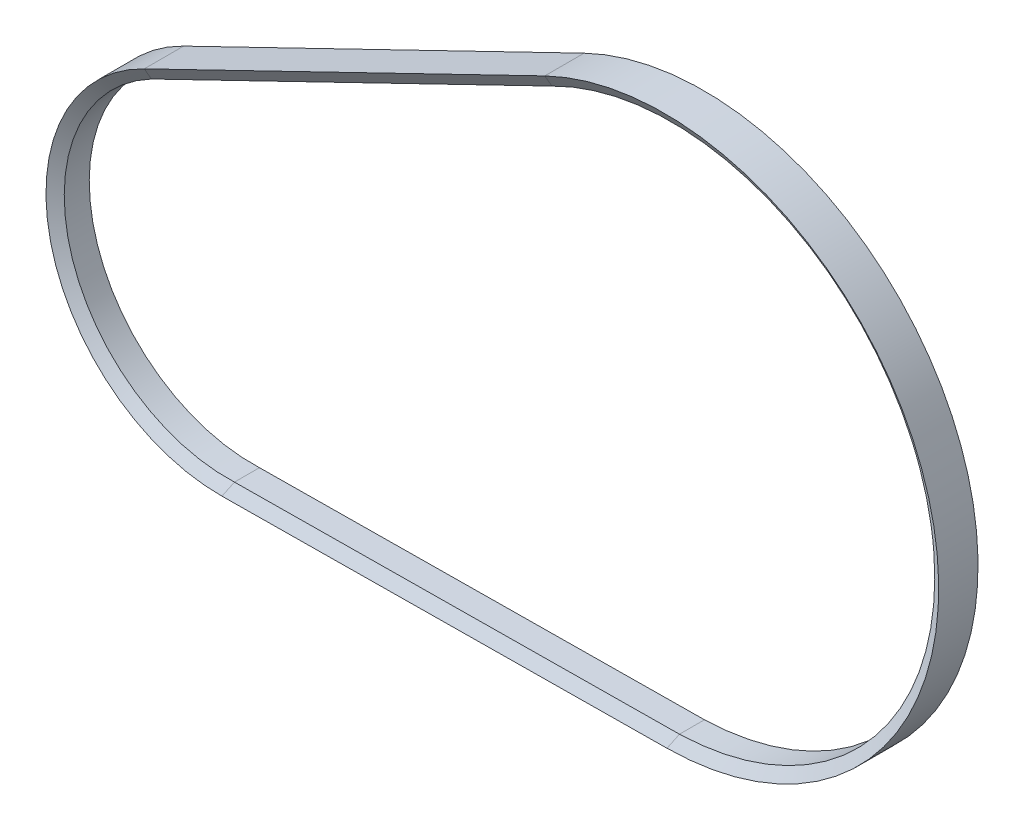
ISO-10303-21;
HEADER;
FILE_DESCRIPTION(('STEP AP214'),'2;1');
FILE_NAME('part.step','',(''),(''),'','','');
FILE_SCHEMA(('AUTOMOTIVE_DESIGN { 1 0 10303 214 1 1 1 1 }'));
ENDSEC;
DATA;
#1=APPLICATION_CONTEXT('core data for automotive mechanical design processes');
#2=APPLICATION_PROTOCOL_DEFINITION('international standard','automotive_design',2000,#1);
#3=PRODUCT_CONTEXT('',#1,'mechanical');
#4=PRODUCT('Part','Part','',(#3));
#5=PRODUCT_RELATED_PRODUCT_CATEGORY('part','',(#4));
#6=PRODUCT_DEFINITION_FORMATION('','',#4);
#7=PRODUCT_DEFINITION_CONTEXT('part definition',#1,'design');
#8=PRODUCT_DEFINITION('design','',#6,#7);
#9=PRODUCT_DEFINITION_SHAPE('','',#8);
#10=(LENGTH_UNIT() NAMED_UNIT(*) SI_UNIT(.MILLI.,.METRE.));
#11=(NAMED_UNIT(*) PLANE_ANGLE_UNIT() SI_UNIT($,.RADIAN.));
#12=(NAMED_UNIT(*) SI_UNIT($,.STERADIAN.) SOLID_ANGLE_UNIT());
#13=UNCERTAINTY_MEASURE_WITH_UNIT(LENGTH_MEASURE(1.E-05),#10,'distance_accuracy_value','');
#14=(GEOMETRIC_REPRESENTATION_CONTEXT(3) GLOBAL_UNCERTAINTY_ASSIGNED_CONTEXT((#13)) GLOBAL_UNIT_ASSIGNED_CONTEXT((#10,
#11,#12)) REPRESENTATION_CONTEXT('',''));
#15=CARTESIAN_POINT('',(0.,0.,0.));
#16=DIRECTION('',(0.,0.,1.));
#17=DIRECTION('',(1.,0.,0.));
#18=AXIS2_PLACEMENT_3D('',#15,#16,#17);
#19=CARTESIAN_POINT('',(-228.321889895203,27.9552544929433,9.4941016151378));
#20=DIRECTION('',(-0.436174862249568,0.89986192804317,0.));
#21=DIRECTION('',(-0.89986192804317,-0.436174862249568,0.));
#22=AXIS2_PLACEMENT_3D('',#19,#20,#21);
#23=PLANE('',#22);
#24=DIRECTION('',(0.89986192804317,0.436174862249568,0.));
#25=VECTOR('',#24,1.);
#26=CARTESIAN_POINT('',(-228.321889895203,27.9552544929433,-9.5041016151378));
#27=LINE('',#26,#25);
#28=CARTESIAN_POINT('',(-228.321889895203,27.9552544929433,-9.5041016151378));
#29=VERTEX_POINT('',#28);
#30=CARTESIAN_POINT('',(-34.990242075409,121.665636306358,-9.5041016151378));
#31=VERTEX_POINT('',#30);
#32=EDGE_CURVE('E11',#29,#31,#27,.T.);
#33=ORIENTED_EDGE('',*,*,#32,.F.);
#34=DIRECTION('',(0.,0.,1.));
#35=VECTOR('',#34,1.);
#36=CARTESIAN_POINT('',(-228.321889895203,27.9552544929433,9.4941016151378));
#37=LINE('',#36,#35);
#38=CARTESIAN_POINT('',(-228.321889895203,27.9552544929433,9.4941016151378));
#39=VERTEX_POINT('',#38);
#40=EDGE_CURVE('E37',#29,#39,#37,.T.);
#41=ORIENTED_EDGE('',*,*,#40,.T.);
#42=DIRECTION('',(0.89986192804317,0.436174862249568,0.));
#43=VECTOR('',#42,1.);
#44=CARTESIAN_POINT('',(-228.321889895203,27.9552544929433,9.4941016151378));
#45=LINE('',#44,#43);
#46=CARTESIAN_POINT('',(-34.990242075409,121.665636306358,9.4941016151378));
#47=VERTEX_POINT('',#46);
#48=EDGE_CURVE('E113',#39,#47,#45,.T.);
#49=ORIENTED_EDGE('',*,*,#48,.T.);
#50=DIRECTION('',(0.,0.,1.));
#51=VECTOR('',#50,1.);
#52=CARTESIAN_POINT('',(-34.990242075409,121.665636306358,9.4941016151378));
#53=LINE('',#52,#51);
#54=EDGE_CURVE('E116',#31,#47,#53,.T.);
#55=ORIENTED_EDGE('',*,*,#54,.F.);
#56=EDGE_LOOP('',(#33,#41,#49,#55));
#57=FACE_BOUND('',#56,.T.);
#58=ADVANCED_FACE('F34',(#57),#23,.T.);
#59=CARTESIAN_POINT('',(-228.321889895203,27.9552544929433,-9.5041016151378));
#60=DIRECTION('',(0.235537887687852,-0.485932583663506,-0.841659923958397));
#61=DIRECTION('',(0.,0.866025403784436,-0.500000000000004));
#62=AXIS2_PLACEMENT_3D('',#59,#60,#61);
#63=PLANE('',#62);
#64=DIRECTION('',(0.89986192804317,0.436174862249568,0.));
#65=VECTOR('',#64,1.);
#66=CARTESIAN_POINT('',(-228.321889895203,21.9552544929433,-6.04));
#67=LINE('',#66,#65);
#68=CARTESIAN_POINT('',(-228.321889895203,21.9552544929433,-6.04));
#69=VERTEX_POINT('',#68);
#70=CARTESIAN_POINT('',(-34.990242075409,115.665636306358,-6.04));
#71=VERTEX_POINT('',#70);
#72=EDGE_CURVE('E42',#69,#71,#67,.T.);
#73=ORIENTED_EDGE('',*,*,#72,.F.);
#74=DIRECTION('',(0.,0.866025403784436,-0.500000000000004));
#75=VECTOR('',#74,1.);
#76=CARTESIAN_POINT('',(-228.321889895203,27.9552544929433,-9.5041016151378));
#77=LINE('',#76,#75);
#78=EDGE_CURVE('E186',#69,#29,#77,.T.);
#79=ORIENTED_EDGE('',*,*,#78,.T.);
#80=ORIENTED_EDGE('',*,*,#32,.T.);
#81=DIRECTION('',(0.,0.866025403784436,-0.500000000000004));
#82=VECTOR('',#81,1.);
#83=CARTESIAN_POINT('',(-34.990242075409,121.665636306358,-9.5041016151378));
#84=LINE('',#83,#82);
#85=EDGE_CURVE('E140',#71,#31,#84,.T.);
#86=ORIENTED_EDGE('',*,*,#85,.F.);
#87=EDGE_LOOP('',(#73,#79,#80,#86));
#88=FACE_BOUND('',#87,.T.);
#89=ADVANCED_FACE('F225',(#88),#63,.T.);
#90=CARTESIAN_POINT('',(-228.321889895203,21.9552544929433,-6.04));
#91=DIRECTION('',(0.436174862249568,-0.89986192804317,0.));
#92=DIRECTION('',(0.89986192804317,0.436174862249568,0.));
#93=AXIS2_PLACEMENT_3D('',#90,#91,#92);
#94=PLANE('',#93);
#95=DIRECTION('',(0.89986192804317,0.436174862249568,0.));
#96=VECTOR('',#95,1.);
#97=CARTESIAN_POINT('',(-228.321889895203,21.9552544929433,6.03));
#98=LINE('',#97,#96);
#99=CARTESIAN_POINT('',(-228.321889895203,21.9552544929433,6.03));
#100=VERTEX_POINT('',#99);
#101=CARTESIAN_POINT('',(-34.990242075409,115.665636306358,6.03));
#102=VERTEX_POINT('',#101);
#103=EDGE_CURVE('E122',#100,#102,#98,.T.);
#104=ORIENTED_EDGE('',*,*,#103,.F.);
#105=DIRECTION('',(0.,0.,-1.));
#106=VECTOR('',#105,1.);
#107=CARTESIAN_POINT('',(-228.321889895203,21.9552544929433,-6.04));
#108=LINE('',#107,#106);
#109=EDGE_CURVE('E167',#100,#69,#108,.T.);
#110=ORIENTED_EDGE('',*,*,#109,.T.);
#111=ORIENTED_EDGE('',*,*,#72,.T.);
#112=DIRECTION('',(0.,0.,-1.));
#113=VECTOR('',#112,1.);
#114=CARTESIAN_POINT('',(-34.990242075409,115.665636306358,-6.04));
#115=LINE('',#114,#113);
#116=EDGE_CURVE('E144',#102,#71,#115,.T.);
#117=ORIENTED_EDGE('',*,*,#116,.F.);
#118=EDGE_LOOP('',(#104,#110,#111,#117));
#119=FACE_BOUND('',#118,.T.);
#120=ADVANCED_FACE('F229',(#119),#94,.T.);
#121=CARTESIAN_POINT('',(-191.609051739656,-47.7861239904502,0.));
#122=DIRECTION('',(0.,0.,-1.));
#123=DIRECTION('',(-1.,0.,0.));
#124=AXIS2_PLACEMENT_3D('',#121,#122,#123);
#125=CYLINDRICAL_SURFACE('',#124,84.17);
#126=ORIENTED_EDGE('',*,*,#40,.F.);
#127=CARTESIAN_POINT('',(-191.609051739656,-47.7861239904502,-9.5041016151378));
#128=DIRECTION('',(0.,0.,-1.));
#129=DIRECTION('',(0.00942624104110603,-0.999955572002994,0.));
#130=AXIS2_PLACEMENT_3D('',#127,#128,#129);
#131=CIRCLE('',#130,84.17);
#132=CARTESIAN_POINT('',(-190.815645031226,-131.952384485942,-9.5041016151378));
#133=VERTEX_POINT('',#132);
#134=EDGE_CURVE('E195',#133,#29,#131,.T.);
#135=ORIENTED_EDGE('',*,*,#134,.F.);
#136=DIRECTION('',(0.,0.,1.));
#137=VECTOR('',#136,1.);
#138=CARTESIAN_POINT('',(-190.815645031226,-131.952384485942,9.4941016151378));
#139=LINE('',#138,#137);
#140=CARTESIAN_POINT('',(-190.815645031226,-131.952384485942,9.4941016151378));
#141=VERTEX_POINT('',#140);
#142=EDGE_CURVE('E170',#133,#141,#139,.T.);
#143=ORIENTED_EDGE('',*,*,#142,.T.);
#144=CARTESIAN_POINT('',(-191.609051739656,-47.7861239904502,9.4941016151378));
#145=DIRECTION('',(0.,0.,-1.));
#146=DIRECTION('',(0.00942624104110603,-0.999955572002994,0.));
#147=AXIS2_PLACEMENT_3D('',#144,#145,#146);
#148=CIRCLE('',#147,84.17);
#149=EDGE_CURVE('E164',#141,#39,#148,.T.);
#150=ORIENTED_EDGE('',*,*,#149,.T.);
#151=EDGE_LOOP('',(#126,#135,#143,#150));
#152=FACE_BOUND('',#151,.T.);
#153=ADVANCED_FACE('F202',(#152),#125,.T.);
#154=CARTESIAN_POINT('',(-188.249606020607,-126.528783855736,-6.04));
#155=CARTESIAN_POINT('',(-295.079412847427,-131.086528511876,-6.04));
#156=CARTESIAN_POINT('',(-322.939699402317,-27.8528852743847,-6.04));
#157=CARTESIAN_POINT('',(-228.321889895203,21.9552544929433,-6.04));
#158=CARTESIAN_POINT('',(-190.815645031227,-131.952384485942,-9.5041016151378));
#159=CARTESIAN_POINT('',(-305.003626050054,-133.028795741819,-9.5041016151378));
#160=CARTESIAN_POINT('',(-331.079871985482,-21.8528852743847,-9.5041016151378));
#161=CARTESIAN_POINT('',(-228.321889895203,27.9552544929433,-9.5041016151378));
#162=(BOUNDED_SURFACE() B_SPLINE_SURFACE(1,3,((#154,#155,#156,#157),(#158,#159,#160,#161)),
.UNSPECIFIED.,.F.,.F.,.F.) B_SPLINE_SURFACE_WITH_KNOTS((2,2),(4,4),(0.,1.),(0.,1.),
.UNSPECIFIED.) GEOMETRIC_REPRESENTATION_ITEM() RATIONAL_B_SPLINE_SURFACE(((1.,0.47944330837667,
0.47944330837667,1.),(1.,0.47944330837667,0.47944330837667,1.))) REPRESENTATION_ITEM('') SURFACE());
#163=CARTESIAN_POINT('',(-191.609051739656,-47.7861239904502,-6.04));
#164=DIRECTION('',(0.,0.,-1.));
#165=DIRECTION('',(0.0426248299075003,-0.999091148932547,0.));
#166=AXIS2_PLACEMENT_3D('',#163,#164,#165);
#167=CIRCLE('',#166,78.8142903171708);
#168=CARTESIAN_POINT('',(-188.249606020607,-126.528783855736,-6.04));
#169=VERTEX_POINT('',#168);
#170=EDGE_CURVE('E183',#169,#69,#167,.T.);
#171=DIRECTION('',(-0.370375828383115,-0.782829320956693,-0.500000000000004));
#172=VECTOR('',#171,1.);
#173=CARTESIAN_POINT('',(-190.815645031226,-131.952384485942,-9.5041016151378));
#174=LINE('',#173,#172);
#175=EDGE_CURVE('E179',#169,#133,#174,.T.);
#176=ORIENTED_EDGE('',*,*,#134,.T.);
#177=ORIENTED_EDGE('',*,*,#78,.F.);
#178=ORIENTED_EDGE('',*,*,#170,.F.);
#179=ORIENTED_EDGE('',*,*,#175,.T.);
#180=EDGE_LOOP('',(#176,#177,#178,#179));
#181=FACE_BOUND('',#180,.T.);
#182=ADVANCED_FACE('F238',(#181),#162,.T.);
#183=CARTESIAN_POINT('',(-191.609051739656,-47.7861239904502,0.));
#184=DIRECTION('',(0.,0.,-1.));
#185=DIRECTION('',(-1.,0.,0.));
#186=AXIS2_PLACEMENT_3D('',#183,#184,#185);
#187=CYLINDRICAL_SURFACE('',#186,78.8142903171708);
#188=ORIENTED_EDGE('',*,*,#170,.T.);
#189=ORIENTED_EDGE('',*,*,#109,.F.);
#190=CARTESIAN_POINT('',(-191.609051739656,-47.7861239904502,6.03));
#191=DIRECTION('',(0.,0.,-1.));
#192=DIRECTION('',(0.0426248299075003,-0.999091148932547,0.));
#193=AXIS2_PLACEMENT_3D('',#190,#191,#192);
#194=CIRCLE('',#193,78.8142903171708);
#195=CARTESIAN_POINT('',(-188.249606020607,-126.528783855736,6.03));
#196=VERTEX_POINT('',#195);
#197=EDGE_CURVE('E163',#196,#100,#194,.T.);
#198=ORIENTED_EDGE('',*,*,#197,.F.);
#199=DIRECTION('',(0.,0.,-1.));
#200=VECTOR('',#199,1.);
#201=CARTESIAN_POINT('',(-188.249606020607,-126.528783855736,-6.04));
#202=LINE('',#201,#200);
#203=EDGE_CURVE('E156',#196,#169,#202,.T.);
#204=ORIENTED_EDGE('',*,*,#203,.T.);
#205=EDGE_LOOP('',(#188,#189,#198,#204));
#206=FACE_BOUND('',#205,.T.);
#207=ADVANCED_FACE('F210',(#206),#187,.F.);
#208=CARTESIAN_POINT('',(-190.815645031227,-131.952384485942,9.4941016151378));
#209=CARTESIAN_POINT('',(-305.003626050054,-133.028795741819,9.4941016151378));
#210=CARTESIAN_POINT('',(-331.079871985482,-21.8528852743847,9.4941016151378));
#211=CARTESIAN_POINT('',(-228.321889895203,27.9552544929433,9.4941016151378));
#212=CARTESIAN_POINT('',(-188.249606020607,-126.528783855736,6.03));
#213=CARTESIAN_POINT('',(-295.079412847427,-131.086528511876,6.03));
#214=CARTESIAN_POINT('',(-322.939699402317,-27.8528852743847,6.03));
#215=CARTESIAN_POINT('',(-228.321889895203,21.9552544929433,6.03));
#216=(BOUNDED_SURFACE() B_SPLINE_SURFACE(1,3,((#208,#209,#210,#211),(#212,#213,#214,#215)),
.UNSPECIFIED.,.F.,.F.,.F.) B_SPLINE_SURFACE_WITH_KNOTS((2,2),(4,4),(0.,1.),(0.,1.),
.UNSPECIFIED.) GEOMETRIC_REPRESENTATION_ITEM() RATIONAL_B_SPLINE_SURFACE(((1.,0.47944330837667,
0.47944330837667,1.),(1.,0.47944330837667,0.47944330837667,1.))) REPRESENTATION_ITEM('') SURFACE());
#217=DIRECTION('',(0.,-0.866025403784436,-0.500000000000004));
#218=VECTOR('',#217,1.);
#219=CARTESIAN_POINT('',(-228.321889895203,21.9552544929433,6.03));
#220=LINE('',#219,#218);
#221=EDGE_CURVE('E161',#39,#100,#220,.T.);
#222=DIRECTION('',(0.370375828383115,0.782829320956693,-0.500000000000004));
#223=VECTOR('',#222,1.);
#224=CARTESIAN_POINT('',(-188.249606020607,-126.528783855736,6.03));
#225=LINE('',#224,#223);
#226=EDGE_CURVE('E153',#141,#196,#225,.T.);
#227=ORIENTED_EDGE('',*,*,#197,.T.);
#228=ORIENTED_EDGE('',*,*,#221,.F.);
#229=ORIENTED_EDGE('',*,*,#149,.F.);
#230=ORIENTED_EDGE('',*,*,#226,.T.);
#231=EDGE_LOOP('',(#227,#228,#229,#230));
#232=FACE_BOUND('',#231,.T.);
#233=ADVANCED_FACE('F207',(#232),#216,.T.);
#234=CARTESIAN_POINT('',(24.0207120333749,-129.927195224756,9.4941016151378));
#235=DIRECTION('',(0.00942624104110505,-0.999955572002994,0.));
#236=DIRECTION('',(0.999955572002994,0.00942624104110505,0.));
#237=AXIS2_PLACEMENT_3D('',#234,#235,#236);
#238=PLANE('',#237);
#239=ORIENTED_EDGE('',*,*,#142,.F.);
#240=DIRECTION('',(-0.999955572002994,-0.00942624104110505,0.));
#241=VECTOR('',#240,1.);
#242=CARTESIAN_POINT('',(24.0207120333749,-129.927195224756,-9.5041016151378));
#243=LINE('',#242,#241);
#244=CARTESIAN_POINT('',(24.020712033375,-129.927195224756,-9.5041016151378));
#245=VERTEX_POINT('',#244);
#246=EDGE_CURVE('E78',#245,#133,#243,.T.);
#247=ORIENTED_EDGE('',*,*,#246,.F.);
#248=DIRECTION('',(0.,0.,1.));
#249=VECTOR('',#248,1.);
#250=CARTESIAN_POINT('',(24.020712033375,-129.927195224756,9.4941016151378));
#251=LINE('',#250,#249);
#252=CARTESIAN_POINT('',(24.020712033375,-129.927195224756,9.4941016151378));
#253=VERTEX_POINT('',#252);
#254=EDGE_CURVE('E160',#245,#253,#251,.T.);
#255=ORIENTED_EDGE('',*,*,#254,.T.);
#256=DIRECTION('',(-0.999955572002994,-0.00942624104110505,0.));
#257=VECTOR('',#256,1.);
#258=CARTESIAN_POINT('',(24.0207120333749,-129.927195224756,9.4941016151378));
#259=LINE('',#258,#257);
#260=EDGE_CURVE('E158',#253,#141,#259,.T.);
#261=ORIENTED_EDGE('',*,*,#260,.T.);
#262=EDGE_LOOP('',(#239,#247,#255,#261));
#263=FACE_BOUND('',#262,.T.);
#264=ADVANCED_FACE('F220',(#263),#238,.T.);
#265=CARTESIAN_POINT('',(24.0207120333749,-129.927195224756,-9.5041016151378));
#266=DIRECTION('',(-0.00509024498158278,0.539983945880221,-0.841659923958397));
#267=DIRECTION('',(0.,0.841670828124574,0.539990941668556));
#268=AXIS2_PLACEMENT_3D('',#265,#266,#267);
#269=PLANE('',#268);
#270=ORIENTED_EDGE('',*,*,#246,.T.);
#271=ORIENTED_EDGE('',*,*,#175,.F.);
#272=DIRECTION('',(-0.999955572002994,-0.00942624104110505,0.));
#273=VECTOR('',#272,1.);
#274=CARTESIAN_POINT('',(26.5867510439948,-124.503594594549,-6.04));
#275=LINE('',#274,#273);
#276=CARTESIAN_POINT('',(26.5867510439949,-124.503594594549,-6.04));
#277=VERTEX_POINT('',#276);
#278=EDGE_CURVE('E88',#277,#169,#275,.T.);
#279=ORIENTED_EDGE('',*,*,#278,.F.);
#280=DIRECTION('',(-0.370375828383115,-0.782829320956693,-0.500000000000004));
#281=VECTOR('',#280,1.);
#282=CARTESIAN_POINT('',(24.020712033375,-129.927195224756,-9.5041016151378));
#283=LINE('',#282,#281);
#284=EDGE_CURVE('E176',#277,#245,#283,.T.);
#285=ORIENTED_EDGE('',*,*,#284,.T.);
#286=EDGE_LOOP('',(#270,#271,#279,#285));
#287=FACE_BOUND('',#286,.T.);
#288=ADVANCED_FACE('F213',(#287),#269,.T.);
#289=CARTESIAN_POINT('',(26.5867510439948,-124.503594594549,-6.04));
#290=DIRECTION('',(-0.00942624104110505,0.999955572002994,0.));
#291=DIRECTION('',(-0.999955572002994,-0.00942624104110505,0.));
#292=AXIS2_PLACEMENT_3D('',#289,#290,#291);
#293=PLANE('',#292);
#294=ORIENTED_EDGE('',*,*,#278,.T.);
#295=ORIENTED_EDGE('',*,*,#203,.F.);
#296=DIRECTION('',(-0.999955572002994,-0.00942624104110505,0.));
#297=VECTOR('',#296,1.);
#298=CARTESIAN_POINT('',(26.5867510439948,-124.503594594549,6.03));
#299=LINE('',#298,#297);
#300=CARTESIAN_POINT('',(26.5867510439949,-124.503594594549,6.03));
#301=VERTEX_POINT('',#300);
#302=EDGE_CURVE('E96',#301,#196,#299,.T.);
#303=ORIENTED_EDGE('',*,*,#302,.F.);
#304=DIRECTION('',(0.,0.,-1.));
#305=VECTOR('',#304,1.);
#306=CARTESIAN_POINT('',(26.5867510439949,-124.503594594549,-6.04));
#307=LINE('',#306,#305);
#308=EDGE_CURVE('E151',#301,#277,#307,.T.);
#309=ORIENTED_EDGE('',*,*,#308,.T.);
#310=EDGE_LOOP('',(#294,#295,#303,#309));
#311=FACE_BOUND('',#310,.T.);
#312=ADVANCED_FACE('F211',(#311),#293,.T.);
#313=CARTESIAN_POINT('',(26.5867510439948,-124.503594594549,6.03));
#314=DIRECTION('',(-0.00509024498158278,0.539983945880221,0.841659923958397));
#315=DIRECTION('',(0.,-0.841670828124574,0.539990941668556));
#316=AXIS2_PLACEMENT_3D('',#313,#314,#315);
#317=PLANE('',#316);
#318=ORIENTED_EDGE('',*,*,#302,.T.);
#319=ORIENTED_EDGE('',*,*,#226,.F.);
#320=ORIENTED_EDGE('',*,*,#260,.F.);
#321=DIRECTION('',(0.370375828383115,0.782829320956693,-0.500000000000004));
#322=VECTOR('',#321,1.);
#323=CARTESIAN_POINT('',(26.5867510439949,-124.503594594549,6.03));
#324=LINE('',#323,#322);
#325=EDGE_CURVE('E132',#253,#301,#324,.T.);
#326=ORIENTED_EDGE('',*,*,#325,.T.);
#327=EDGE_LOOP('',(#318,#319,#320,#326));
#328=FACE_BOUND('',#327,.T.);
#329=ADVANCED_FACE('F205',(#328),#317,.T.);
#330=CARTESIAN_POINT('',(22.7723949323014,2.49692117560056,0.));
#331=DIRECTION('',(0.,0.,-1.));
#332=DIRECTION('',(-1.,0.,0.));
#333=AXIS2_PLACEMENT_3D('',#330,#331,#332);
#334=CYLINDRICAL_SURFACE('',#333,132.43);
#335=ORIENTED_EDGE('',*,*,#254,.F.);
#336=CARTESIAN_POINT('',(22.7723949323014,2.49692117560056,-9.5041016151378));
#337=DIRECTION('',(0.,0.,-1.));
#338=DIRECTION('',(-0.436174862249568,0.899861928043169,0.));
#339=AXIS2_PLACEMENT_3D('',#336,#337,#338);
#340=CIRCLE('',#339,132.43);
#341=EDGE_CURVE('E139',#31,#245,#340,.T.);
#342=ORIENTED_EDGE('',*,*,#341,.F.);
#343=ORIENTED_EDGE('',*,*,#54,.T.);
#344=CARTESIAN_POINT('',(22.7723949323014,2.49692117560056,9.4941016151378));
#345=DIRECTION('',(0.,0.,-1.));
#346=DIRECTION('',(-0.436174862249568,0.899861928043169,0.));
#347=AXIS2_PLACEMENT_3D('',#344,#345,#346);
#348=CIRCLE('',#347,132.43);
#349=EDGE_CURVE('E128',#47,#253,#348,.T.);
#350=ORIENTED_EDGE('',*,*,#349,.T.);
#351=EDGE_LOOP('',(#335,#342,#343,#350));
#352=FACE_BOUND('',#351,.T.);
#353=ADVANCED_FACE('F137',(#352),#334,.T.);
#354=CARTESIAN_POINT('',(-34.990242075409,115.665636306358,-6.04));
#355=CARTESIAN_POINT('',(43.5612052455597,155.759214578311,-6.04));
#356=CARTESIAN_POINT('',(123.946186990181,119.481403112001,-6.04));
#357=CARTESIAN_POINT('',(145.849277898975,34.0526052537306,-6.04));
#358=CARTESIAN_POINT('',(167.752368807768,-51.37619260454,-6.04));
#359=CARTESIAN_POINT('',(114.738978563131,-121.856014891759,-6.04));
#360=CARTESIAN_POINT('',(26.5867510439948,-124.503594594549,-6.04));
#361=CARTESIAN_POINT('',(-34.990242075409,121.665636306358,-9.5041016151378));
#362=CARTESIAN_POINT('',(47.725860498394,161.759214578311,-9.5041016151378));
#363=CARTESIAN_POINT('',(130.713060413809,122.229816735085,-9.5041016151378));
#364=CARTESIAN_POINT('',(151.703404810019,32.7376154783406,-9.5041016151378));
#365=CARTESIAN_POINT('',(172.69374920623,-56.7545857784036,-9.5041016151378));
#366=CARTESIAN_POINT('',(115.937510694822,-129.060726829391,-9.5041016151378));
#367=CARTESIAN_POINT('',(24.0207120333749,-129.927195224756,-9.5041016151378));
#368=(BOUNDED_SURFACE() B_SPLINE_SURFACE(1,3,((#354,#355,#356,#357,#358,#359,#360),(#361,#362,
#363,#364,#365,#366,#367)),.UNSPECIFIED.,.F.,.F.,.F.) B_SPLINE_SURFACE_WITH_KNOTS((2,2),(4,3,4),
(0.,1.),(0.,0.5,1.),
.UNSPECIFIED.) GEOMETRIC_REPRESENTATION_ITEM() RATIONAL_B_SPLINE_SURFACE(((1.,0.749889328618213,
0.749889328618213,1.,0.749889328618213,0.749889328618213,1.),(1.,0.749889328618213,
0.749889328618213,1.,0.749889328618213,0.749889328618213,1.))) REPRESENTATION_ITEM('') SURFACE());
#369=CARTESIAN_POINT('',(22.7723949323014,2.49692117560056,-6.04));
#370=DIRECTION('',(0.,0.,-1.));
#371=DIRECTION('',(-0.454617068465466,0.890686993876,0.));
#372=AXIS2_PLACEMENT_3D('',#369,#370,#371);
#373=CIRCLE('',#372,127.057783383903);
#374=EDGE_CURVE('E173',#71,#277,#373,.T.);
#375=ORIENTED_EDGE('',*,*,#341,.T.);
#376=ORIENTED_EDGE('',*,*,#284,.F.);
#377=ORIENTED_EDGE('',*,*,#374,.F.);
#378=ORIENTED_EDGE('',*,*,#85,.T.);
#379=EDGE_LOOP('',(#375,#376,#377,#378));
#380=FACE_BOUND('',#379,.T.);
#381=ADVANCED_FACE('F243',(#380),#368,.T.);
#382=CARTESIAN_POINT('',(22.7723949323014,2.49692117560056,0.));
#383=DIRECTION('',(0.,0.,-1.));
#384=DIRECTION('',(-1.,0.,0.));
#385=AXIS2_PLACEMENT_3D('',#382,#383,#384);
#386=CYLINDRICAL_SURFACE('',#385,127.057783383903);
#387=ORIENTED_EDGE('',*,*,#374,.T.);
#388=ORIENTED_EDGE('',*,*,#308,.F.);
#389=CARTESIAN_POINT('',(22.7723949323014,2.49692117560056,6.03));
#390=DIRECTION('',(0.,0.,-1.));
#391=DIRECTION('',(-0.454617068465466,0.890686993876,0.));
#392=AXIS2_PLACEMENT_3D('',#389,#390,#391);
#393=CIRCLE('',#392,127.057783383903);
#394=EDGE_CURVE('E150',#102,#301,#393,.T.);
#395=ORIENTED_EDGE('',*,*,#394,.F.);
#396=ORIENTED_EDGE('',*,*,#116,.T.);
#397=EDGE_LOOP('',(#387,#388,#395,#396));
#398=FACE_BOUND('',#397,.T.);
#399=ADVANCED_FACE('F257',(#398),#386,.F.);
#400=CARTESIAN_POINT('',(-34.990242075409,121.665636306358,9.4941016151378));
#401=CARTESIAN_POINT('',(47.725860498394,161.759214578311,9.4941016151378));
#402=CARTESIAN_POINT('',(130.713060413809,122.229816735085,9.4941016151378));
#403=CARTESIAN_POINT('',(151.703404810019,32.7376154783406,9.4941016151378));
#404=CARTESIAN_POINT('',(172.69374920623,-56.7545857784036,9.4941016151378));
#405=CARTESIAN_POINT('',(115.937510694822,-129.060726829391,9.4941016151378));
#406=CARTESIAN_POINT('',(24.0207120333749,-129.927195224756,9.4941016151378));
#407=CARTESIAN_POINT('',(-34.990242075409,115.665636306358,6.03));
#408=CARTESIAN_POINT('',(43.5612052455597,155.759214578311,6.03));
#409=CARTESIAN_POINT('',(123.946186990181,119.481403112001,6.03));
#410=CARTESIAN_POINT('',(145.849277898975,34.0526052537306,6.03));
#411=CARTESIAN_POINT('',(167.752368807768,-51.37619260454,6.03));
#412=CARTESIAN_POINT('',(114.738978563131,-121.856014891759,6.03));
#413=CARTESIAN_POINT('',(26.5867510439948,-124.503594594549,6.03));
#414=(BOUNDED_SURFACE() B_SPLINE_SURFACE(1,3,((#400,#401,#402,#403,#404,#405,#406),(#407,#408,
#409,#410,#411,#412,#413)),.UNSPECIFIED.,.F.,.F.,.F.) B_SPLINE_SURFACE_WITH_KNOTS((2,2),(4,3,4),
(0.,1.),(0.,0.5,1.),
.UNSPECIFIED.) GEOMETRIC_REPRESENTATION_ITEM() RATIONAL_B_SPLINE_SURFACE(((1.,0.749889328618213,
0.749889328618213,1.,0.749889328618213,0.749889328618213,1.),(1.,0.749889328618213,
0.749889328618213,1.,0.749889328618213,0.749889328618213,1.))) REPRESENTATION_ITEM('') SURFACE());
#415=DIRECTION('',(0.,-0.866025403784436,-0.500000000000004));
#416=VECTOR('',#415,1.);
#417=CARTESIAN_POINT('',(-34.990242075409,115.665636306358,6.03));
#418=LINE('',#417,#416);
#419=EDGE_CURVE('E131',#47,#102,#418,.T.);
#420=ORIENTED_EDGE('',*,*,#394,.T.);
#421=ORIENTED_EDGE('',*,*,#325,.F.);
#422=ORIENTED_EDGE('',*,*,#349,.F.);
#423=ORIENTED_EDGE('',*,*,#419,.T.);
#424=EDGE_LOOP('',(#420,#421,#422,#423));
#425=FACE_BOUND('',#424,.T.);
#426=ADVANCED_FACE('F130',(#425),#414,.T.);
#427=CARTESIAN_POINT('',(-228.321889895203,21.9552544929433,6.03));
#428=DIRECTION('',(0.235537887687852,-0.485932583663506,0.841659923958397));
#429=DIRECTION('',(0.,-0.866025403784436,-0.500000000000004));
#430=AXIS2_PLACEMENT_3D('',#427,#428,#429);
#431=PLANE('',#430);
#432=ORIENTED_EDGE('',*,*,#221,.T.);
#433=ORIENTED_EDGE('',*,*,#103,.T.);
#434=ORIENTED_EDGE('',*,*,#419,.F.);
#435=ORIENTED_EDGE('',*,*,#48,.F.);
#436=EDGE_LOOP('',(#432,#433,#434,#435));
#437=FACE_BOUND('',#436,.T.);
#438=ADVANCED_FACE('F142',(#437),#431,.T.);
#439=CLOSED_SHELL('',(#58,#89,#120,#153,#182,#207,#233,#264,#288,#312,#329,#353,#381,#399,#426,#438));
#440=MANIFOLD_SOLID_BREP('B2',#439);
#441=ADVANCED_BREP_SHAPE_REPRESENTATION('',(#18,#440),#14);
#442=SHAPE_DEFINITION_REPRESENTATION(#9,#441);
ENDSEC;
END-ISO-10303-21;
